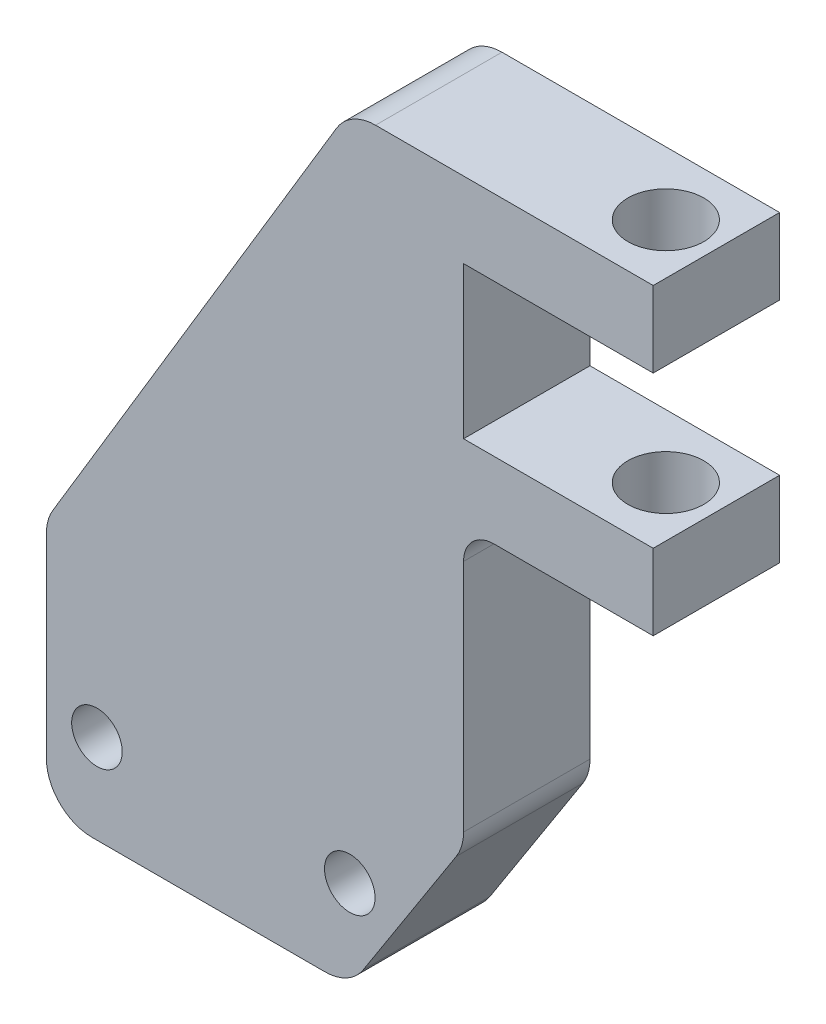
ISO-10303-21;
HEADER;
FILE_DESCRIPTION(('STEP AP214'),'2;1');
FILE_NAME('part.step','',(''),(''),'','','');
FILE_SCHEMA(('AUTOMOTIVE_DESIGN { 1 0 10303 214 1 1 1 1 }'));
ENDSEC;
DATA;
#1=APPLICATION_CONTEXT('core data for automotive mechanical design processes');
#2=APPLICATION_PROTOCOL_DEFINITION('international standard','automotive_design',2000,#1);
#3=PRODUCT_CONTEXT('',#1,'mechanical');
#4=PRODUCT('Part','Part','',(#3));
#5=PRODUCT_RELATED_PRODUCT_CATEGORY('part','',(#4));
#6=PRODUCT_DEFINITION_FORMATION('','',#4);
#7=PRODUCT_DEFINITION_CONTEXT('part definition',#1,'design');
#8=PRODUCT_DEFINITION('design','',#6,#7);
#9=PRODUCT_DEFINITION_SHAPE('','',#8);
#10=(LENGTH_UNIT() NAMED_UNIT(*) SI_UNIT(.MILLI.,.METRE.));
#11=(NAMED_UNIT(*) PLANE_ANGLE_UNIT() SI_UNIT($,.RADIAN.));
#12=(NAMED_UNIT(*) SI_UNIT($,.STERADIAN.) SOLID_ANGLE_UNIT());
#13=UNCERTAINTY_MEASURE_WITH_UNIT(LENGTH_MEASURE(1.E-05),#10,'distance_accuracy_value','');
#14=(GEOMETRIC_REPRESENTATION_CONTEXT(3) GLOBAL_UNCERTAINTY_ASSIGNED_CONTEXT((#13)) GLOBAL_UNIT_ASSIGNED_CONTEXT((#10,
#11,#12)) REPRESENTATION_CONTEXT('',''));
#15=CARTESIAN_POINT('',(0.,0.,0.));
#16=DIRECTION('',(0.,0.,1.));
#17=DIRECTION('',(1.,0.,0.));
#18=AXIS2_PLACEMENT_3D('',#15,#16,#17);
#19=CARTESIAN_POINT('',(7.03861821086262,6.2132587859425,5.));
#20=DIRECTION('',(0.,0.,-1.));
#21=DIRECTION('',(-1.,0.,0.));
#22=AXIS2_PLACEMENT_3D('',#19,#20,#21);
#23=PLANE('',#22);
#24=CARTESIAN_POINT('',(9.0386182108626,9.73823799583506,5.));
#25=DIRECTION('',(0.,0.,1.));
#26=DIRECTION('',(1.,0.,0.));
#27=AXIS2_PLACEMENT_3D('',#24,#25,#26);
#28=CIRCLE('',#27,1.);
#29=CARTESIAN_POINT('',(10.0386182108626,9.73823799583506,5.));
#30=VERTEX_POINT('',#29);
#31=EDGE_CURVE('E217',#30,#30,#28,.T.);
#32=ORIENTED_EDGE('',*,*,#31,.F.);
#33=EDGE_LOOP('',(#32));
#34=FACE_BOUND('',#33,.T.);
#35=DIRECTION('',(-1.,0.,0.));
#36=VECTOR('',#35,1.);
#37=CARTESIAN_POINT('',(19.0386182108626,36.2132587859425,5.));
#38=LINE('',#37,#36);
#39=CARTESIAN_POINT('',(31.0386182108626,36.2132587859425,5.));
#40=VERTEX_POINT('',#39);
#41=CARTESIAN_POINT('',(20.0577608930069,36.2132587859425,5.));
#42=VERTEX_POINT('',#41);
#43=EDGE_CURVE('E204',#40,#42,#38,.T.);
#44=ORIENTED_EDGE('',*,*,#43,.T.);
#45=CARTESIAN_POINT('',(20.0577608930069,34.4132587859425,5.));
#46=DIRECTION('',(0.,0.,-1.));
#47=DIRECTION('',(-1.,0.,0.));
#48=AXIS2_PLACEMENT_3D('',#45,#46,#47);
#49=CIRCLE('',#48,1.8);
#50=CARTESIAN_POINT('',(18.5142736267243,35.339351145712,5.));
#51=VERTEX_POINT('',#50);
#52=EDGE_CURVE('E279',#42,#51,#49,.F.);
#53=ORIENTED_EDGE('',*,*,#52,.T.);
#54=DIRECTION('',(-0.514495755427526,-0.857492925712545,0.));
#55=VECTOR('',#54,1.);
#56=CARTESIAN_POINT('',(7.03861821086262,16.2132587859425,5.));
#57=LINE('',#56,#55);
#58=CARTESIAN_POINT('',(7.29513094458004,16.6407800088049,5.));
#59=VERTEX_POINT('',#58);
#60=EDGE_CURVE('E206',#51,#59,#57,.T.);
#61=ORIENTED_EDGE('',*,*,#60,.T.);
#62=CARTESIAN_POINT('',(8.83861821086261,15.7146876490353,5.));
#63=DIRECTION('',(0.,0.,-1.));
#64=DIRECTION('',(-1.,0.,0.));
#65=AXIS2_PLACEMENT_3D('',#62,#63,#64);
#66=CIRCLE('',#65,1.8);
#67=CARTESIAN_POINT('',(7.03861821086262,15.7146876490353,5.));
#68=VERTEX_POINT('',#67);
#69=EDGE_CURVE('E277',#59,#68,#66,.F.);
#70=ORIENTED_EDGE('',*,*,#69,.T.);
#71=DIRECTION('',(0.,-1.,0.));
#72=VECTOR('',#71,1.);
#73=CARTESIAN_POINT('',(7.03861821086262,6.2132587859425,5.));
#74=LINE('',#73,#72);
#75=CARTESIAN_POINT('',(7.03861821086262,8.0132587859425,5.));
#76=VERTEX_POINT('',#75);
#77=EDGE_CURVE('E209',#68,#76,#74,.T.);
#78=ORIENTED_EDGE('',*,*,#77,.T.);
#79=CARTESIAN_POINT('',(8.83861821086261,8.0132587859425,5.));
#80=DIRECTION('',(0.,0.,-1.));
#81=DIRECTION('',(-1.,0.,0.));
#82=AXIS2_PLACEMENT_3D('',#79,#80,#81);
#83=CIRCLE('',#82,1.8);
#84=CARTESIAN_POINT('',(8.83861821086261,6.2132587859425,5.));
#85=VERTEX_POINT('',#84);
#86=EDGE_CURVE('E271',#76,#85,#83,.F.);
#87=ORIENTED_EDGE('',*,*,#86,.T.);
#88=DIRECTION('',(1.,0.,0.));
#89=VECTOR('',#88,1.);
#90=CARTESIAN_POINT('',(19.0386182108626,6.2132587859425,5.));
#91=LINE('',#90,#89);
#92=CARTESIAN_POINT('',(18.0559060280935,6.2132587859425,5.));
#93=VERTEX_POINT('',#92);
#94=EDGE_CURVE('E242',#85,#93,#91,.T.);
#95=ORIENTED_EDGE('',*,*,#94,.T.);
#96=CARTESIAN_POINT('',(18.0559060280935,8.0132587859425,5.));
#97=DIRECTION('',(0.,0.,-1.));
#98=DIRECTION('',(-1.,0.,0.));
#99=AXIS2_PLACEMENT_3D('',#96,#97,#98);
#100=CIRCLE('',#99,1.8);
#101=CARTESIAN_POINT('',(19.5700272837713,7.0398951215782,5.));
#102=VERTEX_POINT('',#101);
#103=EDGE_CURVE('E273',#93,#102,#100,.F.);
#104=ORIENTED_EDGE('',*,*,#103,.T.);
#105=DIRECTION('',(0.540757591313499,0.841178475376553,0.));
#106=VECTOR('',#105,1.);
#107=CARTESIAN_POINT('',(23.5386182108626,13.2132587859425,5.));
#108=LINE('',#107,#106);
#109=CARTESIAN_POINT('',(23.2527394665404,12.7685585169968,5.));
#110=VERTEX_POINT('',#109);
#111=EDGE_CURVE('E365',#102,#110,#108,.T.);
#112=ORIENTED_EDGE('',*,*,#111,.T.);
#113=CARTESIAN_POINT('',(21.7386182108626,13.7419221813611,5.));
#114=DIRECTION('',(0.,0.,-1.));
#115=DIRECTION('',(-1.,0.,0.));
#116=AXIS2_PLACEMENT_3D('',#113,#114,#115);
#117=CIRCLE('',#116,1.8);
#118=CARTESIAN_POINT('',(23.5386182108626,13.7419221813611,5.));
#119=VERTEX_POINT('',#118);
#120=EDGE_CURVE('E275',#110,#119,#117,.F.);
#121=ORIENTED_EDGE('',*,*,#120,.T.);
#122=DIRECTION('',(0.,1.,0.));
#123=VECTOR('',#122,1.);
#124=CARTESIAN_POINT('',(23.5386182108626,24.2132587859425,5.));
#125=LINE('',#124,#123);
#126=CARTESIAN_POINT('',(23.5386182108626,23.0132587859425,5.));
#127=VERTEX_POINT('',#126);
#128=EDGE_CURVE('E179',#119,#127,#125,.T.);
#129=ORIENTED_EDGE('',*,*,#128,.T.);
#130=CARTESIAN_POINT('',(24.7386182108626,23.0132587859425,5.));
#131=DIRECTION('',(0.,0.,-1.));
#132=DIRECTION('',(-1.,0.,0.));
#133=AXIS2_PLACEMENT_3D('',#130,#131,#132);
#134=CIRCLE('',#133,1.2);
#135=CARTESIAN_POINT('',(24.7386182108626,24.2132587859425,5.));
#136=VERTEX_POINT('',#135);
#137=EDGE_CURVE('E13',#127,#136,#134,.T.);
#138=ORIENTED_EDGE('',*,*,#137,.T.);
#139=DIRECTION('',(1.,0.,0.));
#140=VECTOR('',#139,1.);
#141=CARTESIAN_POINT('',(31.0386182108626,24.2132587859425,5.));
#142=LINE('',#141,#140);
#143=CARTESIAN_POINT('',(31.0386182108626,24.2132587859425,5.));
#144=VERTEX_POINT('',#143);
#145=EDGE_CURVE('E168',#136,#144,#142,.T.);
#146=ORIENTED_EDGE('',*,*,#145,.T.);
#147=DIRECTION('',(0.,1.,0.));
#148=VECTOR('',#147,1.);
#149=CARTESIAN_POINT('',(31.0386182108626,27.2132587859425,5.));
#150=LINE('',#149,#148);
#151=CARTESIAN_POINT('',(31.0386182108626,27.2132587859425,5.));
#152=VERTEX_POINT('',#151);
#153=EDGE_CURVE('E173',#144,#152,#150,.T.);
#154=ORIENTED_EDGE('',*,*,#153,.T.);
#155=DIRECTION('',(-1.,0.,0.));
#156=VECTOR('',#155,1.);
#157=CARTESIAN_POINT('',(23.5386182108626,27.2132587859425,5.));
#158=LINE('',#157,#156);
#159=CARTESIAN_POINT('',(23.5386182108626,27.2132587859425,5.));
#160=VERTEX_POINT('',#159);
#161=EDGE_CURVE('E193',#152,#160,#158,.T.);
#162=ORIENTED_EDGE('',*,*,#161,.T.);
#163=DIRECTION('',(0.,1.,0.));
#164=VECTOR('',#163,1.);
#165=CARTESIAN_POINT('',(23.5386182108626,33.2132587859425,5.));
#166=LINE('',#165,#164);
#167=CARTESIAN_POINT('',(23.5386182108626,33.2132587859425,5.));
#168=VERTEX_POINT('',#167);
#169=EDGE_CURVE('E195',#160,#168,#166,.T.);
#170=ORIENTED_EDGE('',*,*,#169,.T.);
#171=DIRECTION('',(1.,0.,0.));
#172=VECTOR('',#171,1.);
#173=CARTESIAN_POINT('',(31.0386182108626,33.2132587859425,5.));
#174=LINE('',#173,#172);
#175=CARTESIAN_POINT('',(31.0386182108626,33.2132587859425,5.));
#176=VERTEX_POINT('',#175);
#177=EDGE_CURVE('E200',#168,#176,#174,.T.);
#178=ORIENTED_EDGE('',*,*,#177,.T.);
#179=DIRECTION('',(0.,1.,0.));
#180=VECTOR('',#179,1.);
#181=CARTESIAN_POINT('',(31.0386182108626,36.2132587859425,5.));
#182=LINE('',#181,#180);
#183=EDGE_CURVE('E202',#176,#40,#182,.T.);
#184=ORIENTED_EDGE('',*,*,#183,.T.);
#185=EDGE_LOOP('',(#44,#53,#61,#70,#78,#87,#95,#104,#112,#121,#129,#138,#146,#154,#162,#170,
#178,#184));
#186=FACE_BOUND('',#185,.T.);
#187=CARTESIAN_POINT('',(19.0386182108626,9.73823799583506,5.));
#188=DIRECTION('',(0.,0.,1.));
#189=DIRECTION('',(1.,0.,0.));
#190=AXIS2_PLACEMENT_3D('',#187,#188,#189);
#191=CIRCLE('',#190,1.);
#192=CARTESIAN_POINT('',(20.0386182108626,9.73823799583506,5.));
#193=VERTEX_POINT('',#192);
#194=EDGE_CURVE('E373',#193,#193,#191,.T.);
#195=ORIENTED_EDGE('',*,*,#194,.F.);
#196=EDGE_LOOP('',(#195));
#197=FACE_BOUND('',#196,.T.);
#198=ADVANCED_FACE('F44',(#34,#186,#197),#23,.F.);
#199=CARTESIAN_POINT('',(7.03861821086262,6.2132587859425,0.));
#200=DIRECTION('',(0.,0.,-1.));
#201=DIRECTION('',(-1.,0.,0.));
#202=AXIS2_PLACEMENT_3D('',#199,#200,#201);
#203=PLANE('',#202);
#204=CARTESIAN_POINT('',(9.0386182108626,9.73823799583506,0.));
#205=DIRECTION('',(0.,0.,1.));
#206=DIRECTION('',(1.,0.,0.));
#207=AXIS2_PLACEMENT_3D('',#204,#205,#206);
#208=CIRCLE('',#207,1.);
#209=CARTESIAN_POINT('',(10.0386182108626,9.73823799583506,0.));
#210=VERTEX_POINT('',#209);
#211=EDGE_CURVE('E370',#210,#210,#208,.T.);
#212=ORIENTED_EDGE('',*,*,#211,.T.);
#213=EDGE_LOOP('',(#212));
#214=FACE_BOUND('',#213,.T.);
#215=DIRECTION('',(-0.514495755427526,-0.857492925712545,0.));
#216=VECTOR('',#215,1.);
#217=CARTESIAN_POINT('',(7.03861821086262,16.2132587859425,0.));
#218=LINE('',#217,#216);
#219=CARTESIAN_POINT('',(18.5142736267243,35.339351145712,0.));
#220=VERTEX_POINT('',#219);
#221=CARTESIAN_POINT('',(7.29513094458004,16.6407800088049,0.));
#222=VERTEX_POINT('',#221);
#223=EDGE_CURVE('E236',#220,#222,#218,.T.);
#224=ORIENTED_EDGE('',*,*,#223,.F.);
#225=CARTESIAN_POINT('',(20.0577608930069,34.4132587859425,0.));
#226=DIRECTION('',(0.,0.,-1.));
#227=DIRECTION('',(-1.,0.,0.));
#228=AXIS2_PLACEMENT_3D('',#225,#226,#227);
#229=CIRCLE('',#228,1.8);
#230=CARTESIAN_POINT('',(20.0577608930069,36.2132587859425,0.));
#231=VERTEX_POINT('',#230);
#232=EDGE_CURVE('E267',#220,#231,#229,.T.);
#233=ORIENTED_EDGE('',*,*,#232,.T.);
#234=DIRECTION('',(-1.,0.,0.));
#235=VECTOR('',#234,1.);
#236=CARTESIAN_POINT('',(19.0386182108626,36.2132587859425,0.));
#237=LINE('',#236,#235);
#238=CARTESIAN_POINT('',(31.0386182108626,36.2132587859425,0.));
#239=VERTEX_POINT('',#238);
#240=EDGE_CURVE('E233',#239,#231,#237,.T.);
#241=ORIENTED_EDGE('',*,*,#240,.F.);
#242=DIRECTION('',(0.,1.,0.));
#243=VECTOR('',#242,1.);
#244=CARTESIAN_POINT('',(31.0386182108626,36.2132587859425,0.));
#245=LINE('',#244,#243);
#246=CARTESIAN_POINT('',(31.0386182108626,33.2132587859425,0.));
#247=VERTEX_POINT('',#246);
#248=EDGE_CURVE('E231',#247,#239,#245,.T.);
#249=ORIENTED_EDGE('',*,*,#248,.F.);
#250=DIRECTION('',(1.,0.,0.));
#251=VECTOR('',#250,1.);
#252=CARTESIAN_POINT('',(31.0386182108626,33.2132587859425,0.));
#253=LINE('',#252,#251);
#254=CARTESIAN_POINT('',(23.5386182108626,33.2132587859425,0.));
#255=VERTEX_POINT('',#254);
#256=EDGE_CURVE('E229',#255,#247,#253,.T.);
#257=ORIENTED_EDGE('',*,*,#256,.F.);
#258=DIRECTION('',(0.,1.,0.));
#259=VECTOR('',#258,1.);
#260=CARTESIAN_POINT('',(23.5386182108626,33.2132587859425,0.));
#261=LINE('',#260,#259);
#262=CARTESIAN_POINT('',(23.5386182108626,27.2132587859425,0.));
#263=VERTEX_POINT('',#262);
#264=EDGE_CURVE('E227',#263,#255,#261,.T.);
#265=ORIENTED_EDGE('',*,*,#264,.F.);
#266=DIRECTION('',(-1.,0.,0.));
#267=VECTOR('',#266,1.);
#268=CARTESIAN_POINT('',(23.5386182108626,27.2132587859425,0.));
#269=LINE('',#268,#267);
#270=CARTESIAN_POINT('',(31.0386182108626,27.2132587859425,0.));
#271=VERTEX_POINT('',#270);
#272=EDGE_CURVE('E225',#271,#263,#269,.T.);
#273=ORIENTED_EDGE('',*,*,#272,.F.);
#274=DIRECTION('',(0.,1.,0.));
#275=VECTOR('',#274,1.);
#276=CARTESIAN_POINT('',(31.0386182108626,27.2132587859425,0.));
#277=LINE('',#276,#275);
#278=CARTESIAN_POINT('',(31.0386182108626,24.2132587859425,0.));
#279=VERTEX_POINT('',#278);
#280=EDGE_CURVE('E223',#279,#271,#277,.T.);
#281=ORIENTED_EDGE('',*,*,#280,.F.);
#282=DIRECTION('',(1.,0.,0.));
#283=VECTOR('',#282,1.);
#284=CARTESIAN_POINT('',(31.0386182108626,24.2132587859425,0.));
#285=LINE('',#284,#283);
#286=CARTESIAN_POINT('',(24.7386182108626,24.2132587859425,0.));
#287=VERTEX_POINT('',#286);
#288=EDGE_CURVE('E184',#287,#279,#285,.T.);
#289=ORIENTED_EDGE('',*,*,#288,.F.);
#290=CARTESIAN_POINT('',(24.7386182108626,23.0132587859425,0.));
#291=DIRECTION('',(0.,0.,-1.));
#292=DIRECTION('',(-1.,0.,0.));
#293=AXIS2_PLACEMENT_3D('',#290,#291,#292);
#294=CIRCLE('',#293,1.2);
#295=CARTESIAN_POINT('',(23.5386182108626,23.0132587859425,0.));
#296=VERTEX_POINT('',#295);
#297=EDGE_CURVE('E52',#287,#296,#294,.F.);
#298=ORIENTED_EDGE('',*,*,#297,.T.);
#299=DIRECTION('',(0.,1.,0.));
#300=VECTOR('',#299,1.);
#301=CARTESIAN_POINT('',(23.5386182108626,24.2132587859425,0.));
#302=LINE('',#301,#300);
#303=CARTESIAN_POINT('',(23.5386182108626,13.7419221813611,0.));
#304=VERTEX_POINT('',#303);
#305=EDGE_CURVE('E220',#304,#296,#302,.T.);
#306=ORIENTED_EDGE('',*,*,#305,.F.);
#307=CARTESIAN_POINT('',(21.7386182108626,13.7419221813611,0.));
#308=DIRECTION('',(0.,0.,-1.));
#309=DIRECTION('',(-1.,0.,0.));
#310=AXIS2_PLACEMENT_3D('',#307,#308,#309);
#311=CIRCLE('',#310,1.8);
#312=CARTESIAN_POINT('',(23.2527394665404,12.7685585169968,0.));
#313=VERTEX_POINT('',#312);
#314=EDGE_CURVE('E263',#304,#313,#311,.T.);
#315=ORIENTED_EDGE('',*,*,#314,.T.);
#316=DIRECTION('',(0.540757591313499,0.841178475376553,0.));
#317=VECTOR('',#316,1.);
#318=CARTESIAN_POINT('',(23.5386182108626,13.2132587859425,0.));
#319=LINE('',#318,#317);
#320=CARTESIAN_POINT('',(19.5700272837713,7.0398951215782,0.));
#321=VERTEX_POINT('',#320);
#322=EDGE_CURVE('E216',#321,#313,#319,.T.);
#323=ORIENTED_EDGE('',*,*,#322,.F.);
#324=CARTESIAN_POINT('',(18.0559060280935,8.0132587859425,0.));
#325=DIRECTION('',(0.,0.,-1.));
#326=DIRECTION('',(-1.,0.,0.));
#327=AXIS2_PLACEMENT_3D('',#324,#325,#326);
#328=CIRCLE('',#327,1.8);
#329=CARTESIAN_POINT('',(18.0559060280935,6.2132587859425,0.));
#330=VERTEX_POINT('',#329);
#331=EDGE_CURVE('E261',#321,#330,#328,.T.);
#332=ORIENTED_EDGE('',*,*,#331,.T.);
#333=DIRECTION('',(1.,0.,0.));
#334=VECTOR('',#333,1.);
#335=CARTESIAN_POINT('',(19.0386182108626,6.2132587859425,0.));
#336=LINE('',#335,#334);
#337=CARTESIAN_POINT('',(8.83861821086261,6.2132587859425,0.));
#338=VERTEX_POINT('',#337);
#339=EDGE_CURVE('E213',#338,#330,#336,.T.);
#340=ORIENTED_EDGE('',*,*,#339,.F.);
#341=CARTESIAN_POINT('',(8.83861821086261,8.0132587859425,0.));
#342=DIRECTION('',(0.,0.,-1.));
#343=DIRECTION('',(-1.,0.,0.));
#344=AXIS2_PLACEMENT_3D('',#341,#342,#343);
#345=CIRCLE('',#344,1.8);
#346=CARTESIAN_POINT('',(7.03861821086262,8.0132587859425,0.));
#347=VERTEX_POINT('',#346);
#348=EDGE_CURVE('E259',#338,#347,#345,.T.);
#349=ORIENTED_EDGE('',*,*,#348,.T.);
#350=DIRECTION('',(0.,-1.,0.));
#351=VECTOR('',#350,1.);
#352=CARTESIAN_POINT('',(7.03861821086262,6.2132587859425,0.));
#353=LINE('',#352,#351);
#354=CARTESIAN_POINT('',(7.03861821086262,15.7146876490353,0.));
#355=VERTEX_POINT('',#354);
#356=EDGE_CURVE('E239',#355,#347,#353,.T.);
#357=ORIENTED_EDGE('',*,*,#356,.F.);
#358=CARTESIAN_POINT('',(8.83861821086261,15.7146876490353,0.));
#359=DIRECTION('',(0.,0.,-1.));
#360=DIRECTION('',(-1.,0.,0.));
#361=AXIS2_PLACEMENT_3D('',#358,#359,#360);
#362=CIRCLE('',#361,1.8);
#363=EDGE_CURVE('E265',#355,#222,#362,.T.);
#364=ORIENTED_EDGE('',*,*,#363,.T.);
#365=EDGE_LOOP('',(#224,#233,#241,#249,#257,#265,#273,#281,#289,#298,#306,#315,#323,#332,#340,
#349,#357,#364));
#366=FACE_BOUND('',#365,.T.);
#367=CARTESIAN_POINT('',(19.0386182108626,9.73823799583506,0.));
#368=DIRECTION('',(0.,0.,1.));
#369=DIRECTION('',(1.,0.,0.));
#370=AXIS2_PLACEMENT_3D('',#367,#368,#369);
#371=CIRCLE('',#370,1.);
#372=CARTESIAN_POINT('',(20.0386182108626,9.73823799583506,0.));
#373=VERTEX_POINT('',#372);
#374=EDGE_CURVE('E376',#373,#373,#371,.T.);
#375=ORIENTED_EDGE('',*,*,#374,.T.);
#376=EDGE_LOOP('',(#375));
#377=FACE_BOUND('',#376,.T.);
#378=ADVANCED_FACE('F303',(#214,#366,#377),#203,.T.);
#379=CARTESIAN_POINT('',(19.0386182108626,6.2132587859425,5.));
#380=DIRECTION('',(0.,1.,0.));
#381=DIRECTION('',(-1.,0.,0.));
#382=AXIS2_PLACEMENT_3D('',#379,#380,#381);
#383=PLANE('',#382);
#384=ORIENTED_EDGE('',*,*,#339,.T.);
#385=DIRECTION('',(0.,0.,-1.));
#386=VECTOR('',#385,1.);
#387=CARTESIAN_POINT('',(18.0559060280935,6.2132587859425,5.));
#388=LINE('',#387,#386);
#389=EDGE_CURVE('E297',#330,#93,#388,.F.);
#390=ORIENTED_EDGE('',*,*,#389,.T.);
#391=ORIENTED_EDGE('',*,*,#94,.F.);
#392=DIRECTION('',(0.,0.,-1.));
#393=VECTOR('',#392,1.);
#394=CARTESIAN_POINT('',(8.83861821086261,6.2132587859425,5.));
#395=LINE('',#394,#393);
#396=EDGE_CURVE('E294',#85,#338,#395,.T.);
#397=ORIENTED_EDGE('',*,*,#396,.T.);
#398=EDGE_LOOP('',(#384,#390,#391,#397));
#399=FACE_BOUND('',#398,.T.);
#400=ADVANCED_FACE('F353',(#399),#383,.F.);
#401=CARTESIAN_POINT('',(23.5386182108626,13.2132587859425,5.));
#402=DIRECTION('',(-0.841178475376553,0.540757591313499,0.));
#403=DIRECTION('',(-0.540757591313499,-0.841178475376553,0.));
#404=AXIS2_PLACEMENT_3D('',#401,#402,#403);
#405=PLANE('',#404);
#406=ORIENTED_EDGE('',*,*,#322,.T.);
#407=DIRECTION('',(0.,0.,-1.));
#408=VECTOR('',#407,1.);
#409=CARTESIAN_POINT('',(23.2527394665404,12.7685585169968,5.));
#410=LINE('',#409,#408);
#411=EDGE_CURVE('E292',#313,#110,#410,.F.);
#412=ORIENTED_EDGE('',*,*,#411,.T.);
#413=ORIENTED_EDGE('',*,*,#111,.F.);
#414=DIRECTION('',(0.,0.,-1.));
#415=VECTOR('',#414,1.);
#416=CARTESIAN_POINT('',(19.5700272837713,7.0398951215782,5.));
#417=LINE('',#416,#415);
#418=EDGE_CURVE('E289',#102,#321,#417,.T.);
#419=ORIENTED_EDGE('',*,*,#418,.T.);
#420=EDGE_LOOP('',(#406,#412,#413,#419));
#421=FACE_BOUND('',#420,.T.);
#422=ADVANCED_FACE('F362',(#421),#405,.F.);
#423=CARTESIAN_POINT('',(23.5386182108626,24.2132587859425,5.));
#424=DIRECTION('',(-1.,0.,0.));
#425=DIRECTION('',(0.,-1.,0.));
#426=AXIS2_PLACEMENT_3D('',#423,#424,#425);
#427=PLANE('',#426);
#428=ORIENTED_EDGE('',*,*,#305,.T.);
#429=DIRECTION('',(0.,0.,-1.));
#430=VECTOR('',#429,1.);
#431=CARTESIAN_POINT('',(23.5386182108626,23.0132587859425,5.));
#432=LINE('',#431,#430);
#433=EDGE_CURVE('E65',#296,#127,#432,.F.);
#434=ORIENTED_EDGE('',*,*,#433,.T.);
#435=ORIENTED_EDGE('',*,*,#128,.F.);
#436=DIRECTION('',(0.,0.,-1.));
#437=VECTOR('',#436,1.);
#438=CARTESIAN_POINT('',(23.5386182108626,13.7419221813611,5.));
#439=LINE('',#438,#437);
#440=EDGE_CURVE('E286',#119,#304,#439,.T.);
#441=ORIENTED_EDGE('',*,*,#440,.T.);
#442=EDGE_LOOP('',(#428,#434,#435,#441));
#443=FACE_BOUND('',#442,.T.);
#444=ADVANCED_FACE('F448',(#443),#427,.F.);
#445=CARTESIAN_POINT('',(31.0386182108626,24.2132587859425,5.));
#446=DIRECTION('',(0.,1.,0.));
#447=DIRECTION('',(-1.,0.,0.));
#448=AXIS2_PLACEMENT_3D('',#445,#446,#447);
#449=PLANE('',#448);
#450=CARTESIAN_POINT('',(29.0386182108626,24.2132587859425,2.5));
#451=DIRECTION('',(0.,1.,0.));
#452=DIRECTION('',(-1.,0.,0.));
#453=AXIS2_PLACEMENT_3D('',#450,#451,#452);
#454=CIRCLE('',#453,1.5);
#455=CARTESIAN_POINT('',(27.5386182108626,24.2132587859425,2.5));
#456=VERTEX_POINT('',#455);
#457=EDGE_CURVE('E379',#456,#456,#454,.T.);
#458=ORIENTED_EDGE('',*,*,#457,.T.);
#459=EDGE_LOOP('',(#458));
#460=FACE_BOUND('',#459,.T.);
#461=ORIENTED_EDGE('',*,*,#145,.F.);
#462=DIRECTION('',(0.,0.,-1.));
#463=VECTOR('',#462,1.);
#464=CARTESIAN_POINT('',(24.7386182108626,24.2132587859425,0.));
#465=LINE('',#464,#463);
#466=EDGE_CURVE('E299',#136,#287,#465,.T.);
#467=ORIENTED_EDGE('',*,*,#466,.T.);
#468=ORIENTED_EDGE('',*,*,#288,.T.);
#469=DIRECTION('',(0.,0.,-1.));
#470=VECTOR('',#469,1.);
#471=CARTESIAN_POINT('',(31.0386182108626,24.2132587859425,5.));
#472=LINE('',#471,#470);
#473=EDGE_CURVE('E182',#144,#279,#472,.T.);
#474=ORIENTED_EDGE('',*,*,#473,.F.);
#475=EDGE_LOOP('',(#461,#467,#468,#474));
#476=FACE_BOUND('',#475,.T.);
#477=ADVANCED_FACE('F183',(#460,#476),#449,.F.);
#478=CARTESIAN_POINT('',(31.0386182108626,27.2132587859425,5.));
#479=DIRECTION('',(-1.,0.,0.));
#480=DIRECTION('',(0.,0.,1.));
#481=AXIS2_PLACEMENT_3D('',#478,#479,#480);
#482=PLANE('',#481);
#483=ORIENTED_EDGE('',*,*,#280,.T.);
#484=DIRECTION('',(0.,0.,-1.));
#485=VECTOR('',#484,1.);
#486=CARTESIAN_POINT('',(31.0386182108626,27.2132587859425,5.));
#487=LINE('',#486,#485);
#488=EDGE_CURVE('E188',#152,#271,#487,.T.);
#489=ORIENTED_EDGE('',*,*,#488,.F.);
#490=ORIENTED_EDGE('',*,*,#153,.F.);
#491=ORIENTED_EDGE('',*,*,#473,.T.);
#492=EDGE_LOOP('',(#483,#489,#490,#491));
#493=FACE_BOUND('',#492,.T.);
#494=ADVANCED_FACE('F190',(#493),#482,.F.);
#495=CARTESIAN_POINT('',(23.5386182108626,27.2132587859425,5.));
#496=DIRECTION('',(0.,-1.,0.));
#497=DIRECTION('',(0.,0.,-1.));
#498=AXIS2_PLACEMENT_3D('',#495,#496,#497);
#499=PLANE('',#498);
#500=CARTESIAN_POINT('',(29.0386182108626,27.2132587859425,2.5));
#501=DIRECTION('',(0.,-1.,0.));
#502=DIRECTION('',(0.,0.,-1.));
#503=AXIS2_PLACEMENT_3D('',#500,#501,#502);
#504=CIRCLE('',#503,1.5);
#505=CARTESIAN_POINT('',(29.0386182108626,27.2132587859425,0.999999999999999));
#506=VERTEX_POINT('',#505);
#507=EDGE_CURVE('E384',#506,#506,#504,.T.);
#508=ORIENTED_EDGE('',*,*,#507,.T.);
#509=EDGE_LOOP('',(#508));
#510=FACE_BOUND('',#509,.T.);
#511=ORIENTED_EDGE('',*,*,#272,.T.);
#512=DIRECTION('',(0.,0.,-1.));
#513=VECTOR('',#512,1.);
#514=CARTESIAN_POINT('',(23.5386182108626,27.2132587859425,5.));
#515=LINE('',#514,#513);
#516=EDGE_CURVE('E251',#160,#263,#515,.T.);
#517=ORIENTED_EDGE('',*,*,#516,.F.);
#518=ORIENTED_EDGE('',*,*,#161,.F.);
#519=ORIENTED_EDGE('',*,*,#488,.T.);
#520=EDGE_LOOP('',(#511,#517,#518,#519));
#521=FACE_BOUND('',#520,.T.);
#522=ADVANCED_FACE('F308',(#510,#521),#499,.F.);
#523=CARTESIAN_POINT('',(23.5386182108626,33.2132587859425,5.));
#524=DIRECTION('',(-1.,0.,0.));
#525=DIRECTION('',(0.,-1.,0.));
#526=AXIS2_PLACEMENT_3D('',#523,#524,#525);
#527=PLANE('',#526);
#528=ORIENTED_EDGE('',*,*,#264,.T.);
#529=DIRECTION('',(0.,0.,-1.));
#530=VECTOR('',#529,1.);
#531=CARTESIAN_POINT('',(23.5386182108626,33.2132587859425,5.));
#532=LINE('',#531,#530);
#533=EDGE_CURVE('E248',#168,#255,#532,.T.);
#534=ORIENTED_EDGE('',*,*,#533,.F.);
#535=ORIENTED_EDGE('',*,*,#169,.F.);
#536=ORIENTED_EDGE('',*,*,#516,.T.);
#537=EDGE_LOOP('',(#528,#534,#535,#536));
#538=FACE_BOUND('',#537,.T.);
#539=ADVANCED_FACE('F315',(#538),#527,.F.);
#540=CARTESIAN_POINT('',(31.0386182108626,33.2132587859425,5.));
#541=DIRECTION('',(0.,1.,0.));
#542=DIRECTION('',(-1.,0.,0.));
#543=AXIS2_PLACEMENT_3D('',#540,#541,#542);
#544=PLANE('',#543);
#545=CARTESIAN_POINT('',(29.0386182108626,33.2132587859425,2.5));
#546=DIRECTION('',(0.,1.,0.));
#547=DIRECTION('',(-1.,0.,0.));
#548=AXIS2_PLACEMENT_3D('',#545,#546,#547);
#549=CIRCLE('',#548,1.5);
#550=CARTESIAN_POINT('',(27.5386182108626,33.2132587859425,2.5));
#551=VERTEX_POINT('',#550);
#552=EDGE_CURVE('E387',#551,#551,#549,.T.);
#553=ORIENTED_EDGE('',*,*,#552,.T.);
#554=EDGE_LOOP('',(#553));
#555=FACE_BOUND('',#554,.T.);
#556=ORIENTED_EDGE('',*,*,#256,.T.);
#557=DIRECTION('',(0.,0.,-1.));
#558=VECTOR('',#557,1.);
#559=CARTESIAN_POINT('',(31.0386182108626,33.2132587859425,5.));
#560=LINE('',#559,#558);
#561=EDGE_CURVE('E245',#176,#247,#560,.T.);
#562=ORIENTED_EDGE('',*,*,#561,.F.);
#563=ORIENTED_EDGE('',*,*,#177,.F.);
#564=ORIENTED_EDGE('',*,*,#533,.T.);
#565=EDGE_LOOP('',(#556,#562,#563,#564));
#566=FACE_BOUND('',#565,.T.);
#567=ADVANCED_FACE('F318',(#555,#566),#544,.F.);
#568=CARTESIAN_POINT('',(31.0386182108626,36.2132587859425,5.));
#569=DIRECTION('',(-1.,0.,0.));
#570=DIRECTION('',(0.,0.,1.));
#571=AXIS2_PLACEMENT_3D('',#568,#569,#570);
#572=PLANE('',#571);
#573=ORIENTED_EDGE('',*,*,#248,.T.);
#574=DIRECTION('',(0.,0.,-1.));
#575=VECTOR('',#574,1.);
#576=CARTESIAN_POINT('',(31.0386182108626,36.2132587859425,5.));
#577=LINE('',#576,#575);
#578=EDGE_CURVE('E212',#40,#239,#577,.T.);
#579=ORIENTED_EDGE('',*,*,#578,.F.);
#580=ORIENTED_EDGE('',*,*,#183,.F.);
#581=ORIENTED_EDGE('',*,*,#561,.T.);
#582=EDGE_LOOP('',(#573,#579,#580,#581));
#583=FACE_BOUND('',#582,.T.);
#584=ADVANCED_FACE('F323',(#583),#572,.F.);
#585=CARTESIAN_POINT('',(19.0386182108626,36.2132587859425,5.));
#586=DIRECTION('',(0.,-1.,0.));
#587=DIRECTION('',(1.,0.,0.));
#588=AXIS2_PLACEMENT_3D('',#585,#586,#587);
#589=PLANE('',#588);
#590=CARTESIAN_POINT('',(29.0386182108626,36.2132587859425,2.5));
#591=DIRECTION('',(0.,1.,0.));
#592=DIRECTION('',(-1.,0.,0.));
#593=AXIS2_PLACEMENT_3D('',#590,#591,#592);
#594=CIRCLE('',#593,1.5);
#595=CARTESIAN_POINT('',(27.5386182108626,36.2132587859425,2.5));
#596=VERTEX_POINT('',#595);
#597=EDGE_CURVE('E390',#596,#596,#594,.T.);
#598=ORIENTED_EDGE('',*,*,#597,.F.);
#599=EDGE_LOOP('',(#598));
#600=FACE_BOUND('',#599,.T.);
#601=ORIENTED_EDGE('',*,*,#240,.T.);
#602=DIRECTION('',(0.,0.,-1.));
#603=VECTOR('',#602,1.);
#604=CARTESIAN_POINT('',(20.0577608930069,36.2132587859425,5.));
#605=LINE('',#604,#603);
#606=EDGE_CURVE('E269',#231,#42,#605,.F.);
#607=ORIENTED_EDGE('',*,*,#606,.T.);
#608=ORIENTED_EDGE('',*,*,#43,.F.);
#609=ORIENTED_EDGE('',*,*,#578,.T.);
#610=EDGE_LOOP('',(#601,#607,#608,#609));
#611=FACE_BOUND('',#610,.T.);
#612=ADVANCED_FACE('F397',(#600,#611),#589,.F.);
#613=CARTESIAN_POINT('',(7.03861821086262,16.2132587859425,5.));
#614=DIRECTION('',(0.857492925712545,-0.514495755427526,0.));
#615=DIRECTION('',(0.514495755427526,0.857492925712545,0.));
#616=AXIS2_PLACEMENT_3D('',#613,#614,#615);
#617=PLANE('',#616);
#618=ORIENTED_EDGE('',*,*,#60,.F.);
#619=DIRECTION('',(0.,0.,-1.));
#620=VECTOR('',#619,1.);
#621=CARTESIAN_POINT('',(18.5142736267243,35.339351145712,5.));
#622=LINE('',#621,#620);
#623=EDGE_CURVE('E256',#51,#220,#622,.T.);
#624=ORIENTED_EDGE('',*,*,#623,.T.);
#625=ORIENTED_EDGE('',*,*,#223,.T.);
#626=DIRECTION('',(0.,0.,-1.));
#627=VECTOR('',#626,1.);
#628=CARTESIAN_POINT('',(7.29513094458004,16.6407800088049,5.));
#629=LINE('',#628,#627);
#630=EDGE_CURVE('E187',#222,#59,#629,.F.);
#631=ORIENTED_EDGE('',*,*,#630,.T.);
#632=EDGE_LOOP('',(#618,#624,#625,#631));
#633=FACE_BOUND('',#632,.T.);
#634=ADVANCED_FACE('F333',(#633),#617,.F.);
#635=CARTESIAN_POINT('',(7.03861821086262,6.2132587859425,5.));
#636=DIRECTION('',(1.,0.,0.));
#637=DIRECTION('',(0.,0.,-1.));
#638=AXIS2_PLACEMENT_3D('',#635,#636,#637);
#639=PLANE('',#638);
#640=ORIENTED_EDGE('',*,*,#77,.F.);
#641=DIRECTION('',(0.,0.,-1.));
#642=VECTOR('',#641,1.);
#643=CARTESIAN_POINT('',(7.03861821086262,15.7146876490353,5.));
#644=LINE('',#643,#642);
#645=EDGE_CURVE('E283',#68,#355,#644,.T.);
#646=ORIENTED_EDGE('',*,*,#645,.T.);
#647=ORIENTED_EDGE('',*,*,#356,.T.);
#648=DIRECTION('',(0.,0.,-1.));
#649=VECTOR('',#648,1.);
#650=CARTESIAN_POINT('',(7.03861821086262,8.0132587859425,5.));
#651=LINE('',#650,#649);
#652=EDGE_CURVE('E281',#347,#76,#651,.F.);
#653=ORIENTED_EDGE('',*,*,#652,.T.);
#654=EDGE_LOOP('',(#640,#646,#647,#653));
#655=FACE_BOUND('',#654,.T.);
#656=ADVANCED_FACE('F343',(#655),#639,.F.);
#657=CARTESIAN_POINT('',(9.0386182108626,9.73823799583506,5.));
#658=DIRECTION('',(0.,0.,-1.));
#659=DIRECTION('',(-1.,0.,0.));
#660=AXIS2_PLACEMENT_3D('',#657,#658,#659);
#661=CYLINDRICAL_SURFACE('',#660,1.);
#662=ORIENTED_EDGE('',*,*,#31,.T.);
#663=EDGE_LOOP('',(#662));
#664=FACE_BOUND('',#663,.T.);
#665=ORIENTED_EDGE('',*,*,#211,.F.);
#666=EDGE_LOOP('',(#665));
#667=FACE_BOUND('',#666,.T.);
#668=ADVANCED_FACE('F416',(#664,#667),#661,.F.);
#669=CARTESIAN_POINT('',(19.0386182108626,9.73823799583506,5.));
#670=DIRECTION('',(0.,0.,-1.));
#671=DIRECTION('',(-1.,0.,0.));
#672=AXIS2_PLACEMENT_3D('',#669,#670,#671);
#673=CYLINDRICAL_SURFACE('',#672,1.);
#674=ORIENTED_EDGE('',*,*,#194,.T.);
#675=EDGE_LOOP('',(#674));
#676=FACE_BOUND('',#675,.T.);
#677=ORIENTED_EDGE('',*,*,#374,.F.);
#678=EDGE_LOOP('',(#677));
#679=FACE_BOUND('',#678,.T.);
#680=ADVANCED_FACE('F423',(#676,#679),#673,.F.);
#681=CARTESIAN_POINT('',(20.0577608930069,34.4132587859425,5.));
#682=DIRECTION('',(0.,0.,-1.));
#683=DIRECTION('',(-1.,0.,0.));
#684=AXIS2_PLACEMENT_3D('',#681,#682,#683);
#685=CYLINDRICAL_SURFACE('',#684,1.8);
#686=ORIENTED_EDGE('',*,*,#52,.F.);
#687=ORIENTED_EDGE('',*,*,#606,.F.);
#688=ORIENTED_EDGE('',*,*,#232,.F.);
#689=ORIENTED_EDGE('',*,*,#623,.F.);
#690=EDGE_LOOP('',(#686,#687,#688,#689));
#691=FACE_BOUND('',#690,.T.);
#692=ADVANCED_FACE('F331',(#691),#685,.T.);
#693=CARTESIAN_POINT('',(8.83861821086261,15.7146876490353,5.));
#694=DIRECTION('',(0.,0.,-1.));
#695=DIRECTION('',(-1.,0.,0.));
#696=AXIS2_PLACEMENT_3D('',#693,#694,#695);
#697=CYLINDRICAL_SURFACE('',#696,1.8);
#698=ORIENTED_EDGE('',*,*,#69,.F.);
#699=ORIENTED_EDGE('',*,*,#630,.F.);
#700=ORIENTED_EDGE('',*,*,#363,.F.);
#701=ORIENTED_EDGE('',*,*,#645,.F.);
#702=EDGE_LOOP('',(#698,#699,#700,#701));
#703=FACE_BOUND('',#702,.T.);
#704=ADVANCED_FACE('F340',(#703),#697,.T.);
#705=CARTESIAN_POINT('',(21.7386182108626,13.7419221813611,5.));
#706=DIRECTION('',(0.,0.,-1.));
#707=DIRECTION('',(-1.,0.,0.));
#708=AXIS2_PLACEMENT_3D('',#705,#706,#707);
#709=CYLINDRICAL_SURFACE('',#708,1.8);
#710=ORIENTED_EDGE('',*,*,#120,.F.);
#711=ORIENTED_EDGE('',*,*,#411,.F.);
#712=ORIENTED_EDGE('',*,*,#314,.F.);
#713=ORIENTED_EDGE('',*,*,#440,.F.);
#714=EDGE_LOOP('',(#710,#711,#712,#713));
#715=FACE_BOUND('',#714,.T.);
#716=ADVANCED_FACE('F464',(#715),#709,.T.);
#717=CARTESIAN_POINT('',(18.0559060280935,8.0132587859425,5.));
#718=DIRECTION('',(0.,0.,-1.));
#719=DIRECTION('',(-1.,0.,0.));
#720=AXIS2_PLACEMENT_3D('',#717,#718,#719);
#721=CYLINDRICAL_SURFACE('',#720,1.8);
#722=ORIENTED_EDGE('',*,*,#103,.F.);
#723=ORIENTED_EDGE('',*,*,#389,.F.);
#724=ORIENTED_EDGE('',*,*,#331,.F.);
#725=ORIENTED_EDGE('',*,*,#418,.F.);
#726=EDGE_LOOP('',(#722,#723,#724,#725));
#727=FACE_BOUND('',#726,.T.);
#728=ADVANCED_FACE('F359',(#727),#721,.T.);
#729=CARTESIAN_POINT('',(8.83861821086261,8.0132587859425,5.));
#730=DIRECTION('',(0.,0.,-1.));
#731=DIRECTION('',(-1.,0.,0.));
#732=AXIS2_PLACEMENT_3D('',#729,#730,#731);
#733=CYLINDRICAL_SURFACE('',#732,1.8);
#734=ORIENTED_EDGE('',*,*,#86,.F.);
#735=ORIENTED_EDGE('',*,*,#652,.F.);
#736=ORIENTED_EDGE('',*,*,#348,.F.);
#737=ORIENTED_EDGE('',*,*,#396,.F.);
#738=EDGE_LOOP('',(#734,#735,#736,#737));
#739=FACE_BOUND('',#738,.T.);
#740=ADVANCED_FACE('F350',(#739),#733,.T.);
#741=CARTESIAN_POINT('',(24.7386182108626,23.0132587859425,5.));
#742=DIRECTION('',(0.,0.,1.));
#743=DIRECTION('',(1.,0.,0.));
#744=AXIS2_PLACEMENT_3D('',#741,#742,#743);
#745=CYLINDRICAL_SURFACE('',#744,1.2);
#746=ORIENTED_EDGE('',*,*,#137,.F.);
#747=ORIENTED_EDGE('',*,*,#433,.F.);
#748=ORIENTED_EDGE('',*,*,#297,.F.);
#749=ORIENTED_EDGE('',*,*,#466,.F.);
#750=EDGE_LOOP('',(#746,#747,#748,#749));
#751=FACE_BOUND('',#750,.T.);
#752=ADVANCED_FACE('F46',(#751),#745,.F.);
#753=CARTESIAN_POINT('',(29.0386182108626,19.2132587859425,2.5));
#754=DIRECTION('',(0.,1.,0.));
#755=DIRECTION('',(-1.,0.,0.));
#756=AXIS2_PLACEMENT_3D('',#753,#754,#755);
#757=CYLINDRICAL_SURFACE('',#756,1.5);
#758=ORIENTED_EDGE('',*,*,#597,.T.);
#759=EDGE_LOOP('',(#758));
#760=FACE_BOUND('',#759,.T.);
#761=ORIENTED_EDGE('',*,*,#552,.F.);
#762=EDGE_LOOP('',(#761));
#763=FACE_BOUND('',#762,.T.);
#764=ADVANCED_FACE('F394',(#760,#763),#757,.F.);
#765=ORIENTED_EDGE('',*,*,#507,.F.);
#766=EDGE_LOOP('',(#765));
#767=FACE_BOUND('',#766,.T.);
#768=ORIENTED_EDGE('',*,*,#457,.F.);
#769=EDGE_LOOP('',(#768));
#770=FACE_BOUND('',#769,.T.);
#771=ADVANCED_FACE('F437',(#767,#770),#757,.F.);
#772=CLOSED_SHELL('',(#198,#378,#400,#422,#444,#477,#494,#522,#539,#567,#584,#612,#634,#656,
#668,#680,#692,#704,#716,#728,#740,#752,#764,#771));
#773=MANIFOLD_SOLID_BREP('B2',#772);
#774=ADVANCED_BREP_SHAPE_REPRESENTATION('',(#18,#773),#14);
#775=SHAPE_DEFINITION_REPRESENTATION(#9,#774);
ENDSEC;
END-ISO-10303-21;
